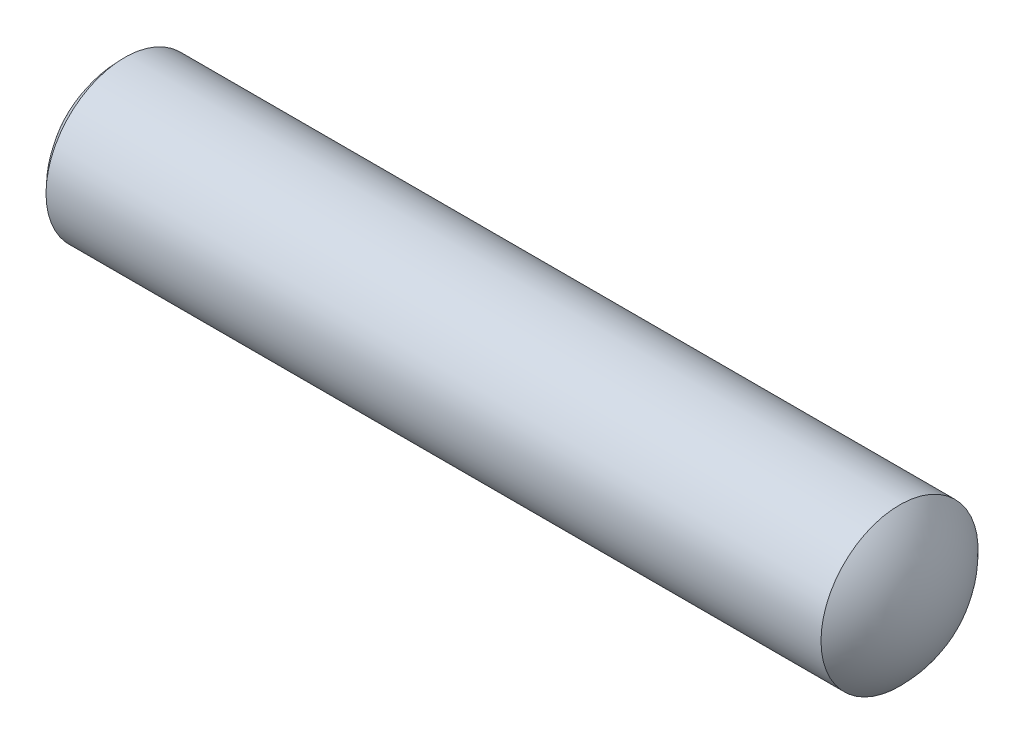
ISO-10303-21;
HEADER;
FILE_DESCRIPTION(('STEP AP214'),'2;1');
FILE_NAME('part.step','',(''),(''),'','','');
FILE_SCHEMA(('AUTOMOTIVE_DESIGN { 1 0 10303 214 1 1 1 1 }'));
ENDSEC;
DATA;
#1=APPLICATION_CONTEXT('core data for automotive mechanical design processes');
#2=APPLICATION_PROTOCOL_DEFINITION('international standard','automotive_design',2000,#1);
#3=PRODUCT_CONTEXT('',#1,'mechanical');
#4=PRODUCT('Part','Part','',(#3));
#5=PRODUCT_RELATED_PRODUCT_CATEGORY('part','',(#4));
#6=PRODUCT_DEFINITION_FORMATION('','',#4);
#7=PRODUCT_DEFINITION_CONTEXT('part definition',#1,'design');
#8=PRODUCT_DEFINITION('design','',#6,#7);
#9=PRODUCT_DEFINITION_SHAPE('','',#8);
#10=(LENGTH_UNIT() NAMED_UNIT(*) SI_UNIT(.MILLI.,.METRE.));
#11=(NAMED_UNIT(*) PLANE_ANGLE_UNIT() SI_UNIT($,.RADIAN.));
#12=(NAMED_UNIT(*) SI_UNIT($,.STERADIAN.) SOLID_ANGLE_UNIT());
#13=UNCERTAINTY_MEASURE_WITH_UNIT(LENGTH_MEASURE(1.E-05),#10,'distance_accuracy_value','');
#14=(GEOMETRIC_REPRESENTATION_CONTEXT(3) GLOBAL_UNCERTAINTY_ASSIGNED_CONTEXT((#13)) GLOBAL_UNIT_ASSIGNED_CONTEXT((#10,
#11,#12)) REPRESENTATION_CONTEXT('',''));
#15=CARTESIAN_POINT('',(0.,0.,0.));
#16=DIRECTION('',(0.,0.,1.));
#17=DIRECTION('',(1.,0.,0.));
#18=AXIS2_PLACEMENT_3D('',#15,#16,#17);
#19=CARTESIAN_POINT('',(15.1875,-8.8535324646027,19.3865319009932));
#20=DIRECTION('',(0.,-0.909631995354518,-0.415415013001887));
#21=DIRECTION('',(1.,0.,0.));
#22=AXIS2_PLACEMENT_3D('',#19,#20,#21);
#23=SPHERICAL_SURFACE('',#22,1.8375);
#24=CARTESIAN_POINT('',(15.1875,-8.8535324646027,19.3865319009932));
#25=DIRECTION('',(-1.,0.,0.));
#26=DIRECTION('',(0.,0.415415013001886,-0.909631995354519));
#27=AXIS2_PLACEMENT_3D('',#24,#25,#26);
#28=SPHERICAL_SURFACE('',#27,1.8375);
#29=CARTESIAN_POINT('',(16.4734821149612,-8.8535324646027,19.3865319009932));
#30=DIRECTION('',(-1.,0.,0.));
#31=DIRECTION('',(0.,0.415415013001886,-0.909631995354519));
#32=AXIS2_PLACEMENT_3D('',#29,#30,#31);
#33=CIRCLE('',#32,1.3125);
#34=CARTESIAN_POINT('',(16.4734821149612,-8.30830026003773,18.1926399070904));
#35=VERTEX_POINT('',#34);
#36=EDGE_CURVE('E11',#35,#35,#33,.T.);
#37=ORIENTED_EDGE('',*,*,#36,.F.);
#38=EDGE_LOOP('',(#37));
#39=FACE_BOUND('',#38,.T.);
#40=ADVANCED_FACE('F17',(#39),#28,.T.);
#41=CARTESIAN_POINT('',(10.,-8.8535324646027,19.3865319009932));
#42=DIRECTION('',(-1.,0.,0.));
#43=DIRECTION('',(0.,0.415415013001886,-0.909631995354519));
#44=AXIS2_PLACEMENT_3D('',#41,#42,#43);
#45=CYLINDRICAL_SURFACE('',#44,1.3125);
#46=CARTESIAN_POINT('',(3.52651788503884,-8.8535324646027,19.3865319009932));
#47=DIRECTION('',(-1.,0.,0.));
#48=DIRECTION('',(0.,0.415415013001886,-0.909631995354519));
#49=AXIS2_PLACEMENT_3D('',#46,#47,#48);
#50=CIRCLE('',#49,1.3125);
#51=CARTESIAN_POINT('',(3.52651788503884,-8.30830026003773,18.1926399070904));
#52=VERTEX_POINT('',#51);
#53=EDGE_CURVE('E20',#52,#52,#50,.T.);
#54=ORIENTED_EDGE('',*,*,#53,.F.);
#55=EDGE_LOOP('',(#54));
#56=FACE_BOUND('',#55,.T.);
#57=ORIENTED_EDGE('',*,*,#36,.T.);
#58=EDGE_LOOP('',(#57));
#59=FACE_BOUND('',#58,.T.);
#60=ADVANCED_FACE('F51',(#56,#59),#45,.T.);
#61=CARTESIAN_POINT('',(4.8125,-8.8535324646027,19.3865319009932));
#62=DIRECTION('',(0.,-0.909631995354518,-0.415415013001887));
#63=DIRECTION('',(-1.,0.,0.));
#64=AXIS2_PLACEMENT_3D('',#61,#62,#63);
#65=SPHERICAL_SURFACE('',#64,1.8375);
#66=CARTESIAN_POINT('',(4.8125,-8.8535324646027,19.3865319009932));
#67=DIRECTION('',(-1.,0.,0.));
#68=DIRECTION('',(0.,0.415415013001886,-0.909631995354519));
#69=AXIS2_PLACEMENT_3D('',#66,#67,#68);
#70=SPHERICAL_SURFACE('',#69,1.8375);
#71=ORIENTED_EDGE('',*,*,#53,.T.);
#72=EDGE_LOOP('',(#71));
#73=FACE_BOUND('',#72,.T.);
#74=ADVANCED_FACE('F39',(#73),#70,.T.);
#75=CLOSED_SHELL('',(#40,#60,#74));
#76=MANIFOLD_SOLID_BREP('B1',#75);
#77=ADVANCED_BREP_SHAPE_REPRESENTATION('',(#18,#76),#14);
#78=SHAPE_DEFINITION_REPRESENTATION(#9,#77);
ENDSEC;
END-ISO-10303-21;
